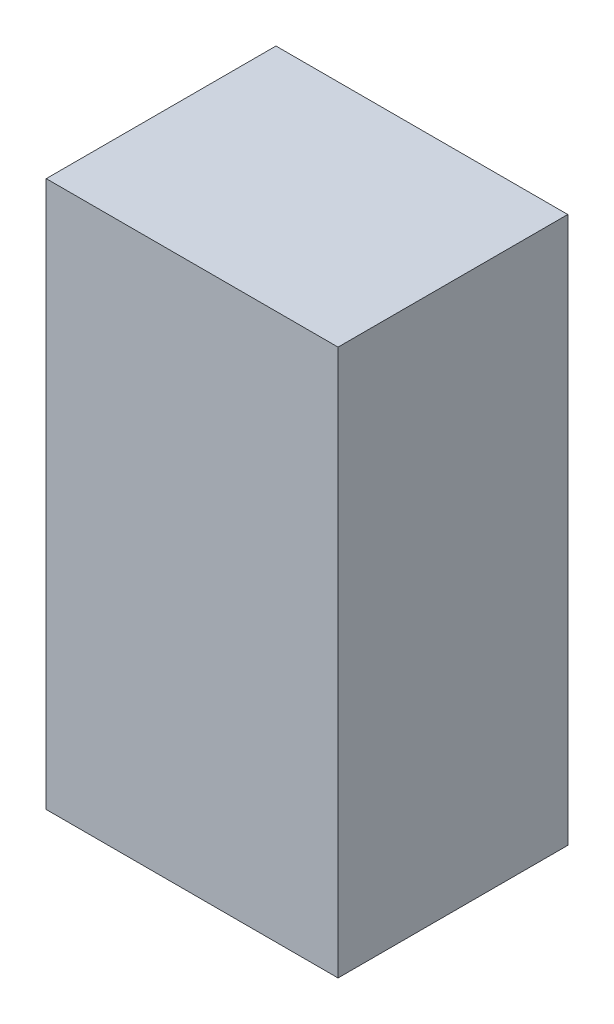
ISO-10303-21;
HEADER;
FILE_DESCRIPTION(('STEP AP214'),'2;1');
FILE_NAME('part.step','',(''),(''),'','','');
FILE_SCHEMA(('AUTOMOTIVE_DESIGN { 1 0 10303 214 1 1 1 1 }'));
ENDSEC;
DATA;
#1=APPLICATION_CONTEXT('core data for automotive mechanical design processes');
#2=APPLICATION_PROTOCOL_DEFINITION('international standard','automotive_design',2000,#1);
#3=PRODUCT_CONTEXT('',#1,'mechanical');
#4=PRODUCT('Part','Part','',(#3));
#5=PRODUCT_RELATED_PRODUCT_CATEGORY('part','',(#4));
#6=PRODUCT_DEFINITION_FORMATION('','',#4);
#7=PRODUCT_DEFINITION_CONTEXT('part definition',#1,'design');
#8=PRODUCT_DEFINITION('design','',#6,#7);
#9=PRODUCT_DEFINITION_SHAPE('','',#8);
#10=(LENGTH_UNIT() NAMED_UNIT(*) SI_UNIT(.MILLI.,.METRE.));
#11=(NAMED_UNIT(*) PLANE_ANGLE_UNIT() SI_UNIT($,.RADIAN.));
#12=(NAMED_UNIT(*) SI_UNIT($,.STERADIAN.) SOLID_ANGLE_UNIT());
#13=UNCERTAINTY_MEASURE_WITH_UNIT(LENGTH_MEASURE(1.E-05),#10,'distance_accuracy_value','');
#14=(GEOMETRIC_REPRESENTATION_CONTEXT(3) GLOBAL_UNCERTAINTY_ASSIGNED_CONTEXT((#13)) GLOBAL_UNIT_ASSIGNED_CONTEXT((#10,
#11,#12)) REPRESENTATION_CONTEXT('',''));
#15=CARTESIAN_POINT('',(0.,0.,0.));
#16=DIRECTION('',(0.,0.,1.));
#17=DIRECTION('',(1.,0.,0.));
#18=AXIS2_PLACEMENT_3D('',#15,#16,#17);
#19=CARTESIAN_POINT('',(298.45,1117.6,234.95));
#20=DIRECTION('',(-1.,0.,0.));
#21=DIRECTION('',(0.,0.,1.));
#22=AXIS2_PLACEMENT_3D('',#19,#20,#21);
#23=PLANE('',#22);
#24=DIRECTION('',(0.,0.,-1.));
#25=VECTOR('',#24,1.);
#26=CARTESIAN_POINT('',(298.45,0.,234.95));
#27=LINE('',#26,#25);
#28=CARTESIAN_POINT('',(298.45,0.,234.95));
#29=VERTEX_POINT('',#28);
#30=CARTESIAN_POINT('',(298.45,0.,-234.95));
#31=VERTEX_POINT('',#30);
#32=EDGE_CURVE('E96',#29,#31,#27,.T.);
#33=ORIENTED_EDGE('',*,*,#32,.T.);
#34=DIRECTION('',(0.,-1.,0.));
#35=VECTOR('',#34,1.);
#36=CARTESIAN_POINT('',(298.45,1117.6,-234.95));
#37=LINE('',#36,#35);
#38=CARTESIAN_POINT('',(298.45,1117.6,-234.95));
#39=VERTEX_POINT('',#38);
#40=EDGE_CURVE('E11',#39,#31,#37,.T.);
#41=ORIENTED_EDGE('',*,*,#40,.F.);
#42=DIRECTION('',(0.,0.,-1.));
#43=VECTOR('',#42,1.);
#44=CARTESIAN_POINT('',(298.45,1117.6,234.95));
#45=LINE('',#44,#43);
#46=CARTESIAN_POINT('',(298.45,1117.6,234.95));
#47=VERTEX_POINT('',#46);
#48=EDGE_CURVE('E84',#47,#39,#45,.T.);
#49=ORIENTED_EDGE('',*,*,#48,.F.);
#50=DIRECTION('',(0.,-1.,0.));
#51=VECTOR('',#50,1.);
#52=CARTESIAN_POINT('',(298.45,1117.6,234.95));
#53=LINE('',#52,#51);
#54=EDGE_CURVE('E92',#47,#29,#53,.T.);
#55=ORIENTED_EDGE('',*,*,#54,.T.);
#56=EDGE_LOOP('',(#33,#41,#49,#55));
#57=FACE_BOUND('',#56,.T.);
#58=ADVANCED_FACE('F33',(#57),#23,.F.);
#59=CARTESIAN_POINT('',(-298.45,1117.6,-234.95));
#60=DIRECTION('',(0.,0.,1.));
#61=DIRECTION('',(1.,0.,0.));
#62=AXIS2_PLACEMENT_3D('',#59,#60,#61);
#63=PLANE('',#62);
#64=DIRECTION('',(-1.,0.,0.));
#65=VECTOR('',#64,1.);
#66=CARTESIAN_POINT('',(-298.45,0.,-234.95));
#67=LINE('',#66,#65);
#68=CARTESIAN_POINT('',(-298.45,0.,-234.95));
#69=VERTEX_POINT('',#68);
#70=EDGE_CURVE('E88',#31,#69,#67,.T.);
#71=ORIENTED_EDGE('',*,*,#70,.T.);
#72=DIRECTION('',(0.,-1.,0.));
#73=VECTOR('',#72,1.);
#74=CARTESIAN_POINT('',(-298.45,1117.6,-234.95));
#75=LINE('',#74,#73);
#76=CARTESIAN_POINT('',(-298.45,1117.6,-234.95));
#77=VERTEX_POINT('',#76);
#78=EDGE_CURVE('E41',#77,#69,#75,.T.);
#79=ORIENTED_EDGE('',*,*,#78,.F.);
#80=DIRECTION('',(-1.,0.,0.));
#81=VECTOR('',#80,1.);
#82=CARTESIAN_POINT('',(-298.45,1117.6,-234.95));
#83=LINE('',#82,#81);
#84=EDGE_CURVE('E79',#39,#77,#83,.T.);
#85=ORIENTED_EDGE('',*,*,#84,.F.);
#86=ORIENTED_EDGE('',*,*,#40,.T.);
#87=EDGE_LOOP('',(#71,#79,#85,#86));
#88=FACE_BOUND('',#87,.T.);
#89=ADVANCED_FACE('F87',(#88),#63,.F.);
#90=CARTESIAN_POINT('',(-298.45,1117.6,234.95));
#91=DIRECTION('',(1.,0.,0.));
#92=DIRECTION('',(0.,0.,-1.));
#93=AXIS2_PLACEMENT_3D('',#90,#91,#92);
#94=PLANE('',#93);
#95=DIRECTION('',(0.,0.,1.));
#96=VECTOR('',#95,1.);
#97=CARTESIAN_POINT('',(-298.45,0.,234.95));
#98=LINE('',#97,#96);
#99=CARTESIAN_POINT('',(-298.45,0.,234.95));
#100=VERTEX_POINT('',#99);
#101=EDGE_CURVE('E66',#69,#100,#98,.T.);
#102=ORIENTED_EDGE('',*,*,#101,.T.);
#103=DIRECTION('',(0.,-1.,0.));
#104=VECTOR('',#103,1.);
#105=CARTESIAN_POINT('',(-298.45,1117.6,234.95));
#106=LINE('',#105,#104);
#107=CARTESIAN_POINT('',(-298.45,1117.6,234.95));
#108=VERTEX_POINT('',#107);
#109=EDGE_CURVE('E89',#108,#100,#106,.T.);
#110=ORIENTED_EDGE('',*,*,#109,.F.);
#111=DIRECTION('',(0.,0.,1.));
#112=VECTOR('',#111,1.);
#113=CARTESIAN_POINT('',(-298.45,1117.6,234.95));
#114=LINE('',#113,#112);
#115=EDGE_CURVE('E82',#77,#108,#114,.T.);
#116=ORIENTED_EDGE('',*,*,#115,.F.);
#117=ORIENTED_EDGE('',*,*,#78,.T.);
#118=EDGE_LOOP('',(#102,#110,#116,#117));
#119=FACE_BOUND('',#118,.T.);
#120=ADVANCED_FACE('F90',(#119),#94,.F.);
#121=CARTESIAN_POINT('',(-298.45,1117.6,234.95));
#122=DIRECTION('',(0.,0.,-1.));
#123=DIRECTION('',(-1.,0.,0.));
#124=AXIS2_PLACEMENT_3D('',#121,#122,#123);
#125=PLANE('',#124);
#126=DIRECTION('',(1.,0.,0.));
#127=VECTOR('',#126,1.);
#128=CARTESIAN_POINT('',(-298.45,0.,234.95));
#129=LINE('',#128,#127);
#130=EDGE_CURVE('E72',#100,#29,#129,.T.);
#131=ORIENTED_EDGE('',*,*,#130,.T.);
#132=ORIENTED_EDGE('',*,*,#54,.F.);
#133=DIRECTION('',(1.,0.,0.));
#134=VECTOR('',#133,1.);
#135=CARTESIAN_POINT('',(-298.45,1117.6,234.95));
#136=LINE('',#135,#134);
#137=EDGE_CURVE('E49',#108,#47,#136,.T.);
#138=ORIENTED_EDGE('',*,*,#137,.F.);
#139=ORIENTED_EDGE('',*,*,#109,.T.);
#140=EDGE_LOOP('',(#131,#132,#138,#139));
#141=FACE_BOUND('',#140,.T.);
#142=ADVANCED_FACE('F103',(#141),#125,.F.);
#143=CARTESIAN_POINT('',(0.,1117.6,0.));
#144=DIRECTION('',(0.,-1.,0.));
#145=DIRECTION('',(0.,0.,-1.));
#146=AXIS2_PLACEMENT_3D('',#143,#144,#145);
#147=PLANE('',#146);
#148=ORIENTED_EDGE('',*,*,#48,.T.);
#149=ORIENTED_EDGE('',*,*,#84,.T.);
#150=ORIENTED_EDGE('',*,*,#115,.T.);
#151=ORIENTED_EDGE('',*,*,#137,.T.);
#152=EDGE_LOOP('',(#148,#149,#150,#151));
#153=FACE_BOUND('',#152,.T.);
#154=ADVANCED_FACE('F80',(#153),#147,.F.);
#155=CARTESIAN_POINT('',(0.,0.,0.));
#156=DIRECTION('',(0.,-1.,0.));
#157=DIRECTION('',(0.,0.,-1.));
#158=AXIS2_PLACEMENT_3D('',#155,#156,#157);
#159=PLANE('',#158);
#160=ORIENTED_EDGE('',*,*,#32,.F.);
#161=ORIENTED_EDGE('',*,*,#130,.F.);
#162=ORIENTED_EDGE('',*,*,#101,.F.);
#163=ORIENTED_EDGE('',*,*,#70,.F.);
#164=EDGE_LOOP('',(#160,#161,#162,#163));
#165=FACE_BOUND('',#164,.T.);
#166=ADVANCED_FACE('F106',(#165),#159,.T.);
#167=CLOSED_SHELL('',(#58,#89,#120,#142,#154,#166));
#168=MANIFOLD_SOLID_BREP('B2',#167);
#169=ADVANCED_BREP_SHAPE_REPRESENTATION('',(#18,#168),#14);
#170=SHAPE_DEFINITION_REPRESENTATION(#9,#169);
ENDSEC;
END-ISO-10303-21;
